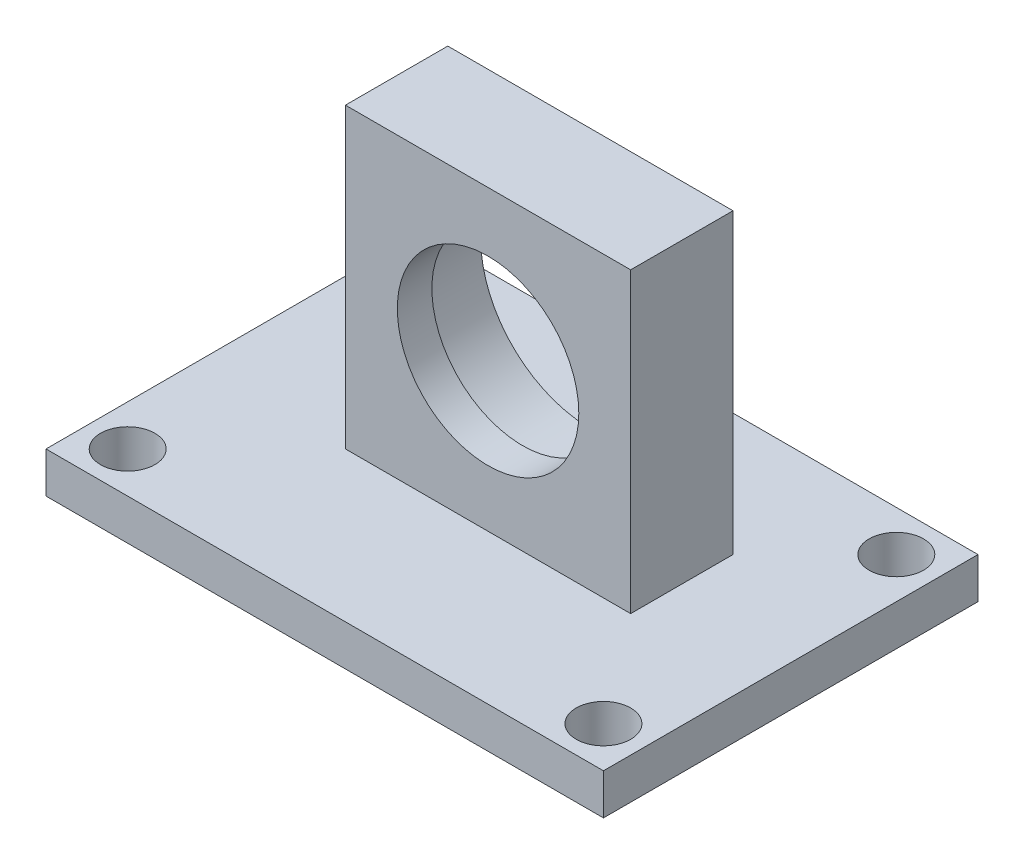
ISO-10303-21;
HEADER;
FILE_DESCRIPTION(('STEP AP214'),'2;1');
FILE_NAME('part.step','',(''),(''),'','','');
FILE_SCHEMA(('AUTOMOTIVE_DESIGN { 1 0 10303 214 1 1 1 1 }'));
ENDSEC;
DATA;
#1=APPLICATION_CONTEXT('core data for automotive mechanical design processes');
#2=APPLICATION_PROTOCOL_DEFINITION('international standard','automotive_design',2000,#1);
#3=PRODUCT_CONTEXT('',#1,'mechanical');
#4=PRODUCT('Part','Part','',(#3));
#5=PRODUCT_RELATED_PRODUCT_CATEGORY('part','',(#4));
#6=PRODUCT_DEFINITION_FORMATION('','',#4);
#7=PRODUCT_DEFINITION_CONTEXT('part definition',#1,'design');
#8=PRODUCT_DEFINITION('design','',#6,#7);
#9=PRODUCT_DEFINITION_SHAPE('','',#8);
#10=(LENGTH_UNIT() NAMED_UNIT(*) SI_UNIT(.MILLI.,.METRE.));
#11=(NAMED_UNIT(*) PLANE_ANGLE_UNIT() SI_UNIT($,.RADIAN.));
#12=(NAMED_UNIT(*) SI_UNIT($,.STERADIAN.) SOLID_ANGLE_UNIT());
#13=UNCERTAINTY_MEASURE_WITH_UNIT(LENGTH_MEASURE(1.E-05),#10,'distance_accuracy_value','');
#14=(GEOMETRIC_REPRESENTATION_CONTEXT(3) GLOBAL_UNCERTAINTY_ASSIGNED_CONTEXT((#13)) GLOBAL_UNIT_ASSIGNED_CONTEXT((#10,
#11,#12)) REPRESENTATION_CONTEXT('',''));
#15=CARTESIAN_POINT('',(0.,0.,0.));
#16=DIRECTION('',(0.,0.,1.));
#17=DIRECTION('',(1.,0.,0.));
#18=AXIS2_PLACEMENT_3D('',#15,#16,#17);
#19=CARTESIAN_POINT('',(0.,0.,0.));
#20=DIRECTION('',(0.,-1.,0.));
#21=DIRECTION('',(0.,0.,-1.));
#22=AXIS2_PLACEMENT_3D('',#19,#20,#21);
#23=PLANE('',#22);
#24=CARTESIAN_POINT('',(37.95500575608,0.,-24.518006082));
#25=DIRECTION('',(0.,1.,0.));
#26=DIRECTION('',(0.,0.,-1.));
#27=AXIS2_PLACEMENT_3D('',#24,#25,#26);
#28=CIRCLE('',#27,1.999996);
#29=CARTESIAN_POINT('',(37.95500575608,0.,-26.518002082));
#30=VERTEX_POINT('',#29);
#31=EDGE_CURVE('E242',#30,#30,#28,.T.);
#32=ORIENTED_EDGE('',*,*,#31,.F.);
#33=EDGE_LOOP('',(#32));
#34=FACE_BOUND('',#33,.T.);
#35=CARTESIAN_POINT('',(37.95500575608,0.,-2.999994));
#36=DIRECTION('',(0.,1.,0.));
#37=DIRECTION('',(0.,0.,-1.));
#38=AXIS2_PLACEMENT_3D('',#35,#36,#37);
#39=CIRCLE('',#38,1.999996);
#40=CARTESIAN_POINT('',(37.95500575608,0.,-4.99999));
#41=VERTEX_POINT('',#40);
#42=EDGE_CURVE('E258',#41,#41,#39,.T.);
#43=ORIENTED_EDGE('',*,*,#42,.F.);
#44=EDGE_LOOP('',(#43));
#45=FACE_BOUND('',#44,.T.);
#46=CARTESIAN_POINT('',(2.999994,0.,-2.999994));
#47=DIRECTION('',(0.,1.,0.));
#48=DIRECTION('',(0.,0.,1.));
#49=AXIS2_PLACEMENT_3D('',#46,#47,#48);
#50=CIRCLE('',#49,1.999996);
#51=CARTESIAN_POINT('',(2.999994,0.,-0.999998));
#52=VERTEX_POINT('',#51);
#53=EDGE_CURVE('E252',#52,#52,#50,.T.);
#54=ORIENTED_EDGE('',*,*,#53,.F.);
#55=EDGE_LOOP('',(#54));
#56=FACE_BOUND('',#55,.T.);
#57=CARTESIAN_POINT('',(2.999994,0.,-24.518006082));
#58=DIRECTION('',(0.,1.,0.));
#59=DIRECTION('',(0.,0.,1.));
#60=AXIS2_PLACEMENT_3D('',#57,#58,#59);
#61=CIRCLE('',#60,1.999996);
#62=CARTESIAN_POINT('',(2.999994,0.,-22.518010082));
#63=VERTEX_POINT('',#62);
#64=EDGE_CURVE('E251',#63,#63,#61,.T.);
#65=ORIENTED_EDGE('',*,*,#64,.F.);
#66=EDGE_LOOP('',(#65));
#67=FACE_BOUND('',#66,.T.);
#68=DIRECTION('',(0.,0.,1.));
#69=VECTOR('',#68,1.);
#70=CARTESIAN_POINT('',(0.,0.,0.));
#71=LINE('',#70,#69);
#72=CARTESIAN_POINT('',(0.,0.,-27.518000082));
#73=VERTEX_POINT('',#72);
#74=CARTESIAN_POINT('',(0.,0.,0.));
#75=VERTEX_POINT('',#74);
#76=EDGE_CURVE('E121',#73,#75,#71,.T.);
#77=ORIENTED_EDGE('',*,*,#76,.T.);
#78=DIRECTION('',(1.,0.,0.));
#79=VECTOR('',#78,1.);
#80=CARTESIAN_POINT('',(0.,0.,0.));
#81=LINE('',#80,#79);
#82=CARTESIAN_POINT('',(40.954999878,0.,0.));
#83=VERTEX_POINT('',#82);
#84=EDGE_CURVE('E124',#75,#83,#81,.T.);
#85=ORIENTED_EDGE('',*,*,#84,.T.);
#86=DIRECTION('',(0.,0.,-1.));
#87=VECTOR('',#86,1.);
#88=CARTESIAN_POINT('',(40.954999878,0.,0.));
#89=LINE('',#88,#87);
#90=CARTESIAN_POINT('',(40.954999878,0.,-27.518000082));
#91=VERTEX_POINT('',#90);
#92=EDGE_CURVE('E145',#83,#91,#89,.T.);
#93=ORIENTED_EDGE('',*,*,#92,.T.);
#94=DIRECTION('',(-1.,0.,0.));
#95=VECTOR('',#94,1.);
#96=CARTESIAN_POINT('',(0.,0.,-27.518000082));
#97=LINE('',#96,#95);
#98=EDGE_CURVE('E134',#91,#73,#97,.T.);
#99=ORIENTED_EDGE('',*,*,#98,.T.);
#100=EDGE_LOOP('',(#77,#85,#93,#99));
#101=FACE_BOUND('',#100,.T.);
#102=DIRECTION('',(0.,0.,1.));
#103=VECTOR('',#102,1.);
#104=CARTESIAN_POINT('',(11.0000034,0.,-18.5184034));
#105=LINE('',#104,#103);
#106=CARTESIAN_POINT('',(11.0000034,0.,-18.5184034));
#107=VERTEX_POINT('',#106);
#108=CARTESIAN_POINT('',(11.0000034,0.,-11.0000034));
#109=VERTEX_POINT('',#108);
#110=EDGE_CURVE('E52',#107,#109,#105,.T.);
#111=ORIENTED_EDGE('',*,*,#110,.F.);
#112=DIRECTION('',(-1.,0.,0.));
#113=VECTOR('',#112,1.);
#114=CARTESIAN_POINT('',(11.0000034,0.,-18.5184034));
#115=LINE('',#114,#113);
#116=CARTESIAN_POINT('',(31.9550034,0.,-18.5184034));
#117=VERTEX_POINT('',#116);
#118=EDGE_CURVE('E56',#117,#107,#115,.T.);
#119=ORIENTED_EDGE('',*,*,#118,.F.);
#120=DIRECTION('',(0.,0.,-1.));
#121=VECTOR('',#120,1.);
#122=CARTESIAN_POINT('',(31.9550034,0.,-18.5184034));
#123=LINE('',#122,#121);
#124=CARTESIAN_POINT('',(31.9550034,0.,-11.0000034));
#125=VERTEX_POINT('',#124);
#126=EDGE_CURVE('E277',#125,#117,#123,.T.);
#127=ORIENTED_EDGE('',*,*,#126,.F.);
#128=DIRECTION('',(1.,0.,0.));
#129=VECTOR('',#128,1.);
#130=CARTESIAN_POINT('',(11.0000034,0.,-11.0000034));
#131=LINE('',#130,#129);
#132=EDGE_CURVE('E275',#109,#125,#131,.T.);
#133=ORIENTED_EDGE('',*,*,#132,.F.);
#134=EDGE_LOOP('',(#111,#119,#127,#133));
#135=FACE_BOUND('',#134,.T.);
#136=ADVANCED_FACE('F35',(#34,#45,#56,#67,#101,#135),#23,.F.);
#137=CARTESIAN_POINT('',(0.,-2.999994,0.));
#138=DIRECTION('',(-1.,0.,0.));
#139=DIRECTION('',(0.,0.,1.));
#140=AXIS2_PLACEMENT_3D('',#137,#138,#139);
#141=PLANE('',#140);
#142=ORIENTED_EDGE('',*,*,#76,.F.);
#143=DIRECTION('',(0.,1.,0.));
#144=VECTOR('',#143,1.);
#145=CARTESIAN_POINT('',(0.,-2.999994,-27.518000082));
#146=LINE('',#145,#144);
#147=CARTESIAN_POINT('',(0.,-2.999994,-27.518000082));
#148=VERTEX_POINT('',#147);
#149=EDGE_CURVE('E11',#148,#73,#146,.T.);
#150=ORIENTED_EDGE('',*,*,#149,.F.);
#151=DIRECTION('',(0.,0.,1.));
#152=VECTOR('',#151,1.);
#153=CARTESIAN_POINT('',(0.,-2.999994,0.));
#154=LINE('',#153,#152);
#155=CARTESIAN_POINT('',(0.,-2.999994,0.));
#156=VERTEX_POINT('',#155);
#157=EDGE_CURVE('E130',#148,#156,#154,.T.);
#158=ORIENTED_EDGE('',*,*,#157,.T.);
#159=DIRECTION('',(0.,1.,0.));
#160=VECTOR('',#159,1.);
#161=CARTESIAN_POINT('',(0.,-2.999994,0.));
#162=LINE('',#161,#160);
#163=EDGE_CURVE('E39',#156,#75,#162,.T.);
#164=ORIENTED_EDGE('',*,*,#163,.T.);
#165=EDGE_LOOP('',(#142,#150,#158,#164));
#166=FACE_BOUND('',#165,.T.);
#167=ADVANCED_FACE('F37',(#166),#141,.T.);
#168=CARTESIAN_POINT('',(0.,-2.999994,-27.518000082));
#169=DIRECTION('',(0.,0.,-1.));
#170=DIRECTION('',(-1.,0.,0.));
#171=AXIS2_PLACEMENT_3D('',#168,#169,#170);
#172=PLANE('',#171);
#173=ORIENTED_EDGE('',*,*,#98,.F.);
#174=DIRECTION('',(0.,1.,0.));
#175=VECTOR('',#174,1.);
#176=CARTESIAN_POINT('',(40.954999878,-2.999994,-27.518000082));
#177=LINE('',#176,#175);
#178=CARTESIAN_POINT('',(40.954999878,-2.999994,-27.518000082));
#179=VERTEX_POINT('',#178);
#180=EDGE_CURVE('E44',#179,#91,#177,.T.);
#181=ORIENTED_EDGE('',*,*,#180,.F.);
#182=DIRECTION('',(-1.,0.,0.));
#183=VECTOR('',#182,1.);
#184=CARTESIAN_POINT('',(0.,-2.999994,-27.518000082));
#185=LINE('',#184,#183);
#186=EDGE_CURVE('E140',#179,#148,#185,.T.);
#187=ORIENTED_EDGE('',*,*,#186,.T.);
#188=ORIENTED_EDGE('',*,*,#149,.T.);
#189=EDGE_LOOP('',(#173,#181,#187,#188));
#190=FACE_BOUND('',#189,.T.);
#191=ADVANCED_FACE('F162',(#190),#172,.T.);
#192=CARTESIAN_POINT('',(40.954999878,-2.999994,0.));
#193=DIRECTION('',(1.,0.,0.));
#194=DIRECTION('',(0.,0.,-1.));
#195=AXIS2_PLACEMENT_3D('',#192,#193,#194);
#196=PLANE('',#195);
#197=ORIENTED_EDGE('',*,*,#92,.F.);
#198=DIRECTION('',(0.,1.,0.));
#199=VECTOR('',#198,1.);
#200=CARTESIAN_POINT('',(40.954999878,-2.999994,0.));
#201=LINE('',#200,#199);
#202=CARTESIAN_POINT('',(40.954999878,-2.999994,0.));
#203=VERTEX_POINT('',#202);
#204=EDGE_CURVE('E150',#203,#83,#201,.T.);
#205=ORIENTED_EDGE('',*,*,#204,.F.);
#206=DIRECTION('',(0.,0.,-1.));
#207=VECTOR('',#206,1.);
#208=CARTESIAN_POINT('',(40.954999878,-2.999994,0.));
#209=LINE('',#208,#207);
#210=EDGE_CURVE('E137',#203,#179,#209,.T.);
#211=ORIENTED_EDGE('',*,*,#210,.T.);
#212=ORIENTED_EDGE('',*,*,#180,.T.);
#213=EDGE_LOOP('',(#197,#205,#211,#212));
#214=FACE_BOUND('',#213,.T.);
#215=ADVANCED_FACE('F168',(#214),#196,.T.);
#216=CARTESIAN_POINT('',(0.,-2.999994,0.));
#217=DIRECTION('',(0.,0.,1.));
#218=DIRECTION('',(1.,0.,0.));
#219=AXIS2_PLACEMENT_3D('',#216,#217,#218);
#220=PLANE('',#219);
#221=ORIENTED_EDGE('',*,*,#84,.F.);
#222=ORIENTED_EDGE('',*,*,#163,.F.);
#223=DIRECTION('',(1.,0.,0.));
#224=VECTOR('',#223,1.);
#225=CARTESIAN_POINT('',(0.,-2.999994,0.));
#226=LINE('',#225,#224);
#227=EDGE_CURVE('E133',#156,#203,#226,.T.);
#228=ORIENTED_EDGE('',*,*,#227,.T.);
#229=ORIENTED_EDGE('',*,*,#204,.T.);
#230=EDGE_LOOP('',(#221,#222,#228,#229));
#231=FACE_BOUND('',#230,.T.);
#232=ADVANCED_FACE('F158',(#231),#220,.T.);
#233=CARTESIAN_POINT('',(0.,-2.999994,0.));
#234=DIRECTION('',(0.,-1.,0.));
#235=DIRECTION('',(0.,0.,-1.));
#236=AXIS2_PLACEMENT_3D('',#233,#234,#235);
#237=PLANE('',#236);
#238=CARTESIAN_POINT('',(37.95500575608,-2.999994,-24.518006082));
#239=DIRECTION('',(0.,1.,0.));
#240=DIRECTION('',(0.,0.,-1.));
#241=AXIS2_PLACEMENT_3D('',#238,#239,#240);
#242=CIRCLE('',#241,1.999996);
#243=CARTESIAN_POINT('',(37.95500575608,-2.999994,-26.518002082));
#244=VERTEX_POINT('',#243);
#245=EDGE_CURVE('E261',#244,#244,#242,.T.);
#246=ORIENTED_EDGE('',*,*,#245,.T.);
#247=EDGE_LOOP('',(#246));
#248=FACE_BOUND('',#247,.T.);
#249=CARTESIAN_POINT('',(37.95500575608,-2.999994,-2.999994));
#250=DIRECTION('',(0.,1.,0.));
#251=DIRECTION('',(0.,0.,-1.));
#252=AXIS2_PLACEMENT_3D('',#249,#250,#251);
#253=CIRCLE('',#252,1.999996);
#254=CARTESIAN_POINT('',(37.95500575608,-2.999994,-4.99999));
#255=VERTEX_POINT('',#254);
#256=EDGE_CURVE('E255',#255,#255,#253,.T.);
#257=ORIENTED_EDGE('',*,*,#256,.T.);
#258=EDGE_LOOP('',(#257));
#259=FACE_BOUND('',#258,.T.);
#260=CARTESIAN_POINT('',(2.999994,-2.999994,-2.999994));
#261=DIRECTION('',(0.,1.,0.));
#262=DIRECTION('',(0.,0.,1.));
#263=AXIS2_PLACEMENT_3D('',#260,#261,#262);
#264=CIRCLE('',#263,1.999996);
#265=CARTESIAN_POINT('',(2.999994,-2.999994,-0.999998));
#266=VERTEX_POINT('',#265);
#267=EDGE_CURVE('E248',#266,#266,#264,.T.);
#268=ORIENTED_EDGE('',*,*,#267,.T.);
#269=EDGE_LOOP('',(#268));
#270=FACE_BOUND('',#269,.T.);
#271=CARTESIAN_POINT('',(2.999994,-2.999994,-24.518006082));
#272=DIRECTION('',(0.,1.,0.));
#273=DIRECTION('',(0.,0.,1.));
#274=AXIS2_PLACEMENT_3D('',#271,#272,#273);
#275=CIRCLE('',#274,1.999996);
#276=CARTESIAN_POINT('',(2.999994,-2.999994,-22.518010082));
#277=VERTEX_POINT('',#276);
#278=EDGE_CURVE('E266',#277,#277,#275,.T.);
#279=ORIENTED_EDGE('',*,*,#278,.T.);
#280=EDGE_LOOP('',(#279));
#281=FACE_BOUND('',#280,.T.);
#282=ORIENTED_EDGE('',*,*,#157,.F.);
#283=ORIENTED_EDGE('',*,*,#186,.F.);
#284=ORIENTED_EDGE('',*,*,#210,.F.);
#285=ORIENTED_EDGE('',*,*,#227,.F.);
#286=EDGE_LOOP('',(#282,#283,#284,#285));
#287=FACE_BOUND('',#286,.T.);
#288=ADVANCED_FACE('F165',(#248,#259,#270,#281,#287),#237,.T.);
#289=CARTESIAN_POINT('',(11.0000034,21.8749999888,-18.5184034));
#290=DIRECTION('',(1.,0.,0.));
#291=DIRECTION('',(0.,0.,-1.));
#292=AXIS2_PLACEMENT_3D('',#289,#290,#291);
#293=PLANE('',#292);
#294=ORIENTED_EDGE('',*,*,#110,.T.);
#295=DIRECTION('',(0.,-1.,0.));
#296=VECTOR('',#295,1.);
#297=CARTESIAN_POINT('',(11.0000034,21.8749999888,-11.0000034));
#298=LINE('',#297,#296);
#299=CARTESIAN_POINT('',(11.0000034,21.8749999888,-11.0000034));
#300=VERTEX_POINT('',#299);
#301=EDGE_CURVE('E104',#300,#109,#298,.T.);
#302=ORIENTED_EDGE('',*,*,#301,.F.);
#303=DIRECTION('',(0.,0.,1.));
#304=VECTOR('',#303,1.);
#305=CARTESIAN_POINT('',(11.0000034,21.8749999888,-18.5184034));
#306=LINE('',#305,#304);
#307=CARTESIAN_POINT('',(11.0000034,21.8749999888,-18.5184034));
#308=VERTEX_POINT('',#307);
#309=EDGE_CURVE('E110',#308,#300,#306,.T.);
#310=ORIENTED_EDGE('',*,*,#309,.F.);
#311=DIRECTION('',(0.,-1.,0.));
#312=VECTOR('',#311,1.);
#313=CARTESIAN_POINT('',(11.0000034,21.8749999888,-18.5184034));
#314=LINE('',#313,#312);
#315=EDGE_CURVE('E273',#308,#107,#314,.T.);
#316=ORIENTED_EDGE('',*,*,#315,.T.);
#317=EDGE_LOOP('',(#294,#302,#310,#316));
#318=FACE_BOUND('',#317,.T.);
#319=ADVANCED_FACE('F120',(#318),#293,.F.);
#320=CARTESIAN_POINT('',(11.0000034,21.8749999888,-11.0000034));
#321=DIRECTION('',(0.,0.,-1.));
#322=DIRECTION('',(-1.,0.,0.));
#323=AXIS2_PLACEMENT_3D('',#320,#321,#322);
#324=PLANE('',#323);
#325=CARTESIAN_POINT('',(21.4775034,10.843006,-11.0000034));
#326=DIRECTION('',(0.,0.,1.));
#327=DIRECTION('',(1.,0.,0.));
#328=AXIS2_PLACEMENT_3D('',#325,#326,#327);
#329=CIRCLE('',#328,6.6675);
#330=CARTESIAN_POINT('',(28.1450034,10.843006,-11.0000034));
#331=VERTEX_POINT('',#330);
#332=EDGE_CURVE('E239',#331,#331,#329,.T.);
#333=ORIENTED_EDGE('',*,*,#332,.F.);
#334=EDGE_LOOP('',(#333));
#335=FACE_BOUND('',#334,.T.);
#336=ORIENTED_EDGE('',*,*,#132,.T.);
#337=DIRECTION('',(0.,-1.,0.));
#338=VECTOR('',#337,1.);
#339=CARTESIAN_POINT('',(31.9550034,21.8749999888,-11.0000034));
#340=LINE('',#339,#338);
#341=CARTESIAN_POINT('',(31.9550034,21.8749999888,-11.0000034));
#342=VERTEX_POINT('',#341);
#343=EDGE_CURVE('E106',#342,#125,#340,.T.);
#344=ORIENTED_EDGE('',*,*,#343,.F.);
#345=DIRECTION('',(1.,0.,0.));
#346=VECTOR('',#345,1.);
#347=CARTESIAN_POINT('',(11.0000034,21.8749999888,-11.0000034));
#348=LINE('',#347,#346);
#349=EDGE_CURVE('E99',#300,#342,#348,.T.);
#350=ORIENTED_EDGE('',*,*,#349,.F.);
#351=ORIENTED_EDGE('',*,*,#301,.T.);
#352=EDGE_LOOP('',(#336,#344,#350,#351));
#353=FACE_BOUND('',#352,.T.);
#354=ADVANCED_FACE('F102',(#335,#353),#324,.F.);
#355=CARTESIAN_POINT('',(31.9550034,21.8749999888,-18.5184034));
#356=DIRECTION('',(-1.,0.,0.));
#357=DIRECTION('',(0.,0.,1.));
#358=AXIS2_PLACEMENT_3D('',#355,#356,#357);
#359=PLANE('',#358);
#360=ORIENTED_EDGE('',*,*,#126,.T.);
#361=DIRECTION('',(0.,-1.,0.));
#362=VECTOR('',#361,1.);
#363=CARTESIAN_POINT('',(31.9550034,21.8749999888,-18.5184034));
#364=LINE('',#363,#362);
#365=CARTESIAN_POINT('',(31.9550034,21.8749999888,-18.5184034));
#366=VERTEX_POINT('',#365);
#367=EDGE_CURVE('E126',#366,#117,#364,.T.);
#368=ORIENTED_EDGE('',*,*,#367,.F.);
#369=DIRECTION('',(0.,0.,-1.));
#370=VECTOR('',#369,1.);
#371=CARTESIAN_POINT('',(31.9550034,21.8749999888,-18.5184034));
#372=LINE('',#371,#370);
#373=EDGE_CURVE('E109',#342,#366,#372,.T.);
#374=ORIENTED_EDGE('',*,*,#373,.F.);
#375=ORIENTED_EDGE('',*,*,#343,.T.);
#376=EDGE_LOOP('',(#360,#368,#374,#375));
#377=FACE_BOUND('',#376,.T.);
#378=ADVANCED_FACE('F192',(#377),#359,.F.);
#379=CARTESIAN_POINT('',(11.0000034,21.8749999888,-18.5184034));
#380=DIRECTION('',(0.,0.,1.));
#381=DIRECTION('',(1.,0.,0.));
#382=AXIS2_PLACEMENT_3D('',#379,#380,#381);
#383=PLANE('',#382);
#384=CARTESIAN_POINT('',(21.4775034,10.843006,-18.5184034));
#385=DIRECTION('',(0.,0.,-1.));
#386=DIRECTION('',(-1.,0.,0.));
#387=AXIS2_PLACEMENT_3D('',#384,#385,#386);
#388=CIRCLE('',#387,8.0645);
#389=CARTESIAN_POINT('',(13.4130034,10.843006,-18.5184034));
#390=VERTEX_POINT('',#389);
#391=EDGE_CURVE('E244',#390,#390,#388,.T.);
#392=ORIENTED_EDGE('',*,*,#391,.F.);
#393=EDGE_LOOP('',(#392));
#394=FACE_BOUND('',#393,.T.);
#395=ORIENTED_EDGE('',*,*,#118,.T.);
#396=ORIENTED_EDGE('',*,*,#315,.F.);
#397=DIRECTION('',(-1.,0.,0.));
#398=VECTOR('',#397,1.);
#399=CARTESIAN_POINT('',(11.0000034,21.8749999888,-18.5184034));
#400=LINE('',#399,#398);
#401=EDGE_CURVE('E115',#366,#308,#400,.T.);
#402=ORIENTED_EDGE('',*,*,#401,.F.);
#403=ORIENTED_EDGE('',*,*,#367,.T.);
#404=EDGE_LOOP('',(#395,#396,#402,#403));
#405=FACE_BOUND('',#404,.T.);
#406=ADVANCED_FACE('F196',(#394,#405),#383,.F.);
#407=CARTESIAN_POINT('',(0.,21.8749999888,0.));
#408=DIRECTION('',(0.,1.,0.));
#409=DIRECTION('',(0.,0.,1.));
#410=AXIS2_PLACEMENT_3D('',#407,#408,#409);
#411=PLANE('',#410);
#412=ORIENTED_EDGE('',*,*,#309,.T.);
#413=ORIENTED_EDGE('',*,*,#349,.T.);
#414=ORIENTED_EDGE('',*,*,#373,.T.);
#415=ORIENTED_EDGE('',*,*,#401,.T.);
#416=EDGE_LOOP('',(#412,#413,#414,#415));
#417=FACE_BOUND('',#416,.T.);
#418=ADVANCED_FACE('F113',(#417),#411,.T.);
#419=CARTESIAN_POINT('',(2.999994,-2.999994,-24.518006082));
#420=DIRECTION('',(0.,1.,0.));
#421=DIRECTION('',(0.,0.,1.));
#422=AXIS2_PLACEMENT_3D('',#419,#420,#421);
#423=CYLINDRICAL_SURFACE('',#422,1.999996);
#424=ORIENTED_EDGE('',*,*,#278,.F.);
#425=EDGE_LOOP('',(#424));
#426=FACE_BOUND('',#425,.T.);
#427=ORIENTED_EDGE('',*,*,#64,.T.);
#428=EDGE_LOOP('',(#427));
#429=FACE_BOUND('',#428,.T.);
#430=ADVANCED_FACE('F203',(#426,#429),#423,.F.);
#431=CARTESIAN_POINT('',(2.999994,-2.999994,-2.999994));
#432=DIRECTION('',(0.,1.,0.));
#433=DIRECTION('',(0.,0.,1.));
#434=AXIS2_PLACEMENT_3D('',#431,#432,#433);
#435=CYLINDRICAL_SURFACE('',#434,1.999996);
#436=ORIENTED_EDGE('',*,*,#267,.F.);
#437=EDGE_LOOP('',(#436));
#438=FACE_BOUND('',#437,.T.);
#439=ORIENTED_EDGE('',*,*,#53,.T.);
#440=EDGE_LOOP('',(#439));
#441=FACE_BOUND('',#440,.T.);
#442=ADVANCED_FACE('F206',(#438,#441),#435,.F.);
#443=CARTESIAN_POINT('',(37.95500575608,-2.999994,-2.999994));
#444=DIRECTION('',(0.,1.,0.));
#445=DIRECTION('',(0.,0.,1.));
#446=AXIS2_PLACEMENT_3D('',#443,#444,#445);
#447=CYLINDRICAL_SURFACE('',#446,1.999996);
#448=ORIENTED_EDGE('',*,*,#256,.F.);
#449=EDGE_LOOP('',(#448));
#450=FACE_BOUND('',#449,.T.);
#451=ORIENTED_EDGE('',*,*,#42,.T.);
#452=EDGE_LOOP('',(#451));
#453=FACE_BOUND('',#452,.T.);
#454=ADVANCED_FACE('F212',(#450,#453),#447,.F.);
#455=CARTESIAN_POINT('',(37.95500575608,-2.999994,-24.518006082));
#456=DIRECTION('',(0.,1.,0.));
#457=DIRECTION('',(0.,0.,1.));
#458=AXIS2_PLACEMENT_3D('',#455,#456,#457);
#459=CYLINDRICAL_SURFACE('',#458,1.999996);
#460=ORIENTED_EDGE('',*,*,#245,.F.);
#461=EDGE_LOOP('',(#460));
#462=FACE_BOUND('',#461,.T.);
#463=ORIENTED_EDGE('',*,*,#31,.T.);
#464=EDGE_LOOP('',(#463));
#465=FACE_BOUND('',#464,.T.);
#466=ADVANCED_FACE('F208',(#462,#465),#459,.F.);
#467=CARTESIAN_POINT('',(21.4775034,10.843006,-13.5400034));
#468=DIRECTION('',(0.,0.,1.));
#469=DIRECTION('',(1.,0.,0.));
#470=AXIS2_PLACEMENT_3D('',#467,#468,#469);
#471=CYLINDRICAL_SURFACE('',#470,6.6675);
#472=CARTESIAN_POINT('',(21.4775034,10.843006,-13.5400034));
#473=DIRECTION('',(0.,0.,1.));
#474=DIRECTION('',(1.,0.,0.));
#475=AXIS2_PLACEMENT_3D('',#472,#473,#474);
#476=CIRCLE('',#475,6.6675);
#477=CARTESIAN_POINT('',(28.1450034,10.843006,-13.5400034));
#478=VERTEX_POINT('',#477);
#479=EDGE_CURVE('E238',#478,#478,#476,.T.);
#480=ORIENTED_EDGE('',*,*,#479,.F.);
#481=EDGE_LOOP('',(#480));
#482=FACE_BOUND('',#481,.T.);
#483=ORIENTED_EDGE('',*,*,#332,.T.);
#484=EDGE_LOOP('',(#483));
#485=FACE_BOUND('',#484,.T.);
#486=ADVANCED_FACE('F211',(#482,#485),#471,.F.);
#487=CARTESIAN_POINT('',(21.4775034,10.843006,-13.5400034));
#488=DIRECTION('',(0.,0.,-1.));
#489=DIRECTION('',(-1.,0.,0.));
#490=AXIS2_PLACEMENT_3D('',#487,#488,#489);
#491=PLANE('',#490);
#492=CARTESIAN_POINT('',(21.4775034,10.843006,-13.5400034));
#493=DIRECTION('',(0.,0.,-1.));
#494=DIRECTION('',(-1.,0.,0.));
#495=AXIS2_PLACEMENT_3D('',#492,#493,#494);
#496=CIRCLE('',#495,8.0645);
#497=CARTESIAN_POINT('',(13.4130034,10.843006,-13.5400034));
#498=VERTEX_POINT('',#497);
#499=EDGE_CURVE('E235',#498,#498,#496,.T.);
#500=ORIENTED_EDGE('',*,*,#499,.T.);
#501=EDGE_LOOP('',(#500));
#502=FACE_BOUND('',#501,.T.);
#503=ORIENTED_EDGE('',*,*,#479,.T.);
#504=EDGE_LOOP('',(#503));
#505=FACE_BOUND('',#504,.T.);
#506=ADVANCED_FACE('F222',(#502,#505),#491,.T.);
#507=CARTESIAN_POINT('',(21.4775034,10.843006,-13.5400034));
#508=DIRECTION('',(0.,0.,-1.));
#509=DIRECTION('',(-1.,0.,0.));
#510=AXIS2_PLACEMENT_3D('',#507,#508,#509);
#511=CYLINDRICAL_SURFACE('',#510,8.0645);
#512=ORIENTED_EDGE('',*,*,#499,.F.);
#513=EDGE_LOOP('',(#512));
#514=FACE_BOUND('',#513,.T.);
#515=ORIENTED_EDGE('',*,*,#391,.T.);
#516=EDGE_LOOP('',(#515));
#517=FACE_BOUND('',#516,.T.);
#518=ADVANCED_FACE('F224',(#514,#517),#511,.F.);
#519=CLOSED_SHELL('',(#136,#167,#191,#215,#232,#288,#319,#354,#378,#406,#418,#430,#442,#454,
#466,#486,#506,#518));
#520=MANIFOLD_SOLID_BREP('B2',#519);
#521=ADVANCED_BREP_SHAPE_REPRESENTATION('',(#18,#520),#14);
#522=SHAPE_DEFINITION_REPRESENTATION(#9,#521);
ENDSEC;
END-ISO-10303-21;
